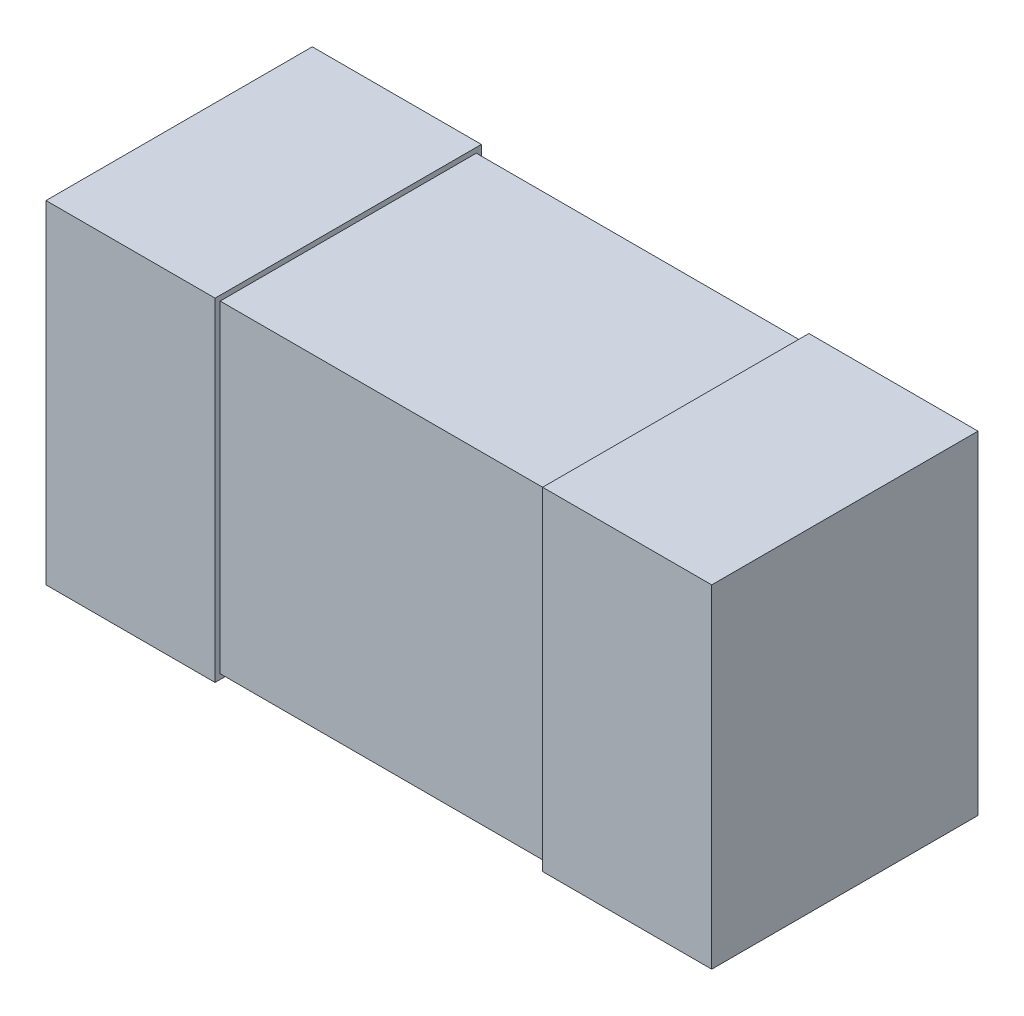
ISO-10303-21;
HEADER;
FILE_DESCRIPTION(('STEP AP214'),'2;1');
FILE_NAME('part.step','',(''),(''),'','','');
FILE_SCHEMA(('AUTOMOTIVE_DESIGN { 1 0 10303 214 1 1 1 1 }'));
ENDSEC;
DATA;
#1=APPLICATION_CONTEXT('core data for automotive mechanical design processes');
#2=APPLICATION_PROTOCOL_DEFINITION('international standard','automotive_design',2000,#1);
#3=PRODUCT_CONTEXT('',#1,'mechanical');
#4=PRODUCT('Part','Part','',(#3));
#5=PRODUCT_RELATED_PRODUCT_CATEGORY('part','',(#4));
#6=PRODUCT_DEFINITION_FORMATION('','',#4);
#7=PRODUCT_DEFINITION_CONTEXT('part definition',#1,'design');
#8=PRODUCT_DEFINITION('design','',#6,#7);
#9=PRODUCT_DEFINITION_SHAPE('','',#8);
#10=(LENGTH_UNIT() NAMED_UNIT(*) SI_UNIT(.MILLI.,.METRE.));
#11=(NAMED_UNIT(*) PLANE_ANGLE_UNIT() SI_UNIT($,.RADIAN.));
#12=(NAMED_UNIT(*) SI_UNIT($,.STERADIAN.) SOLID_ANGLE_UNIT());
#13=UNCERTAINTY_MEASURE_WITH_UNIT(LENGTH_MEASURE(1.E-05),#10,'distance_accuracy_value','');
#14=(GEOMETRIC_REPRESENTATION_CONTEXT(3) GLOBAL_UNCERTAINTY_ASSIGNED_CONTEXT((#13)) GLOBAL_UNIT_ASSIGNED_CONTEXT((#10,
#11,#12)) REPRESENTATION_CONTEXT('',''));
#15=CARTESIAN_POINT('',(0.,0.,0.));
#16=DIRECTION('',(0.,0.,1.));
#17=DIRECTION('',(1.,0.,0.));
#18=AXIS2_PLACEMENT_3D('',#15,#16,#17);
#19=CARTESIAN_POINT('',(0.5,-0.25,0.0762));
#20=DIRECTION('',(1.,0.,0.));
#21=DIRECTION('',(0.,1.,0.));
#22=AXIS2_PLACEMENT_3D('',#19,#20,#21);
#23=PLANE('',#22);
#24=DIRECTION('',(0.,1.,0.));
#25=VECTOR('',#24,1.);
#26=CARTESIAN_POINT('',(0.5,-0.25,0.0762));
#27=LINE('',#26,#25);
#28=CARTESIAN_POINT('',(0.5,-0.25,0.0762));
#29=VERTEX_POINT('',#28);
#30=CARTESIAN_POINT('',(0.5,0.25,0.0762));
#31=VERTEX_POINT('',#30);
#32=EDGE_CURVE('E147',#29,#31,#27,.T.);
#33=ORIENTED_EDGE('',*,*,#32,.T.);
#34=DIRECTION('',(0.,0.,1.));
#35=VECTOR('',#34,1.);
#36=CARTESIAN_POINT('',(0.5,0.25,0.0762));
#37=LINE('',#36,#35);
#38=CARTESIAN_POINT('',(0.5,0.25,0.4762));
#39=VERTEX_POINT('',#38);
#40=EDGE_CURVE('E231',#31,#39,#37,.T.);
#41=ORIENTED_EDGE('',*,*,#40,.T.);
#42=DIRECTION('',(0.,1.,0.));
#43=VECTOR('',#42,1.);
#44=CARTESIAN_POINT('',(0.5,-0.25,0.4762));
#45=LINE('',#44,#43);
#46=CARTESIAN_POINT('',(0.5,-0.25,0.4762));
#47=VERTEX_POINT('',#46);
#48=EDGE_CURVE('E188',#47,#39,#45,.T.);
#49=ORIENTED_EDGE('',*,*,#48,.F.);
#50=DIRECTION('',(0.,0.,1.));
#51=VECTOR('',#50,1.);
#52=CARTESIAN_POINT('',(0.5,-0.25,0.0762));
#53=LINE('',#52,#51);
#54=EDGE_CURVE('E11',#29,#47,#53,.T.);
#55=ORIENTED_EDGE('',*,*,#54,.F.);
#56=EDGE_LOOP('',(#33,#41,#49,#55));
#57=FACE_BOUND('',#56,.T.);
#58=ADVANCED_FACE('F17',(#57),#23,.T.);
#59=CARTESIAN_POINT('',(-0.5,0.25,0.0762));
#60=DIRECTION('',(-1.,0.,0.));
#61=DIRECTION('',(0.,0.,1.));
#62=AXIS2_PLACEMENT_3D('',#59,#60,#61);
#63=PLANE('',#62);
#64=DIRECTION('',(0.,-1.,0.));
#65=VECTOR('',#64,1.);
#66=CARTESIAN_POINT('',(-0.5,0.25,0.0762));
#67=LINE('',#66,#65);
#68=CARTESIAN_POINT('',(-0.5,0.25,0.0762));
#69=VERTEX_POINT('',#68);
#70=CARTESIAN_POINT('',(-0.5,-0.25,0.0762));
#71=VERTEX_POINT('',#70);
#72=EDGE_CURVE('E166',#69,#71,#67,.T.);
#73=ORIENTED_EDGE('',*,*,#72,.T.);
#74=DIRECTION('',(0.,0.,1.));
#75=VECTOR('',#74,1.);
#76=CARTESIAN_POINT('',(-0.5,-0.25,0.0762));
#77=LINE('',#76,#75);
#78=CARTESIAN_POINT('',(-0.5,-0.25,0.4762));
#79=VERTEX_POINT('',#78);
#80=EDGE_CURVE('E28',#71,#79,#77,.T.);
#81=ORIENTED_EDGE('',*,*,#80,.T.);
#82=DIRECTION('',(0.,-1.,0.));
#83=VECTOR('',#82,1.);
#84=CARTESIAN_POINT('',(-0.5,0.25,0.4762));
#85=LINE('',#84,#83);
#86=CARTESIAN_POINT('',(-0.5,0.25,0.4762));
#87=VERTEX_POINT('',#86);
#88=EDGE_CURVE('E220',#87,#79,#85,.T.);
#89=ORIENTED_EDGE('',*,*,#88,.F.);
#90=DIRECTION('',(0.,0.,1.));
#91=VECTOR('',#90,1.);
#92=CARTESIAN_POINT('',(-0.5,0.25,0.0762));
#93=LINE('',#92,#91);
#94=EDGE_CURVE('E222',#69,#87,#93,.T.);
#95=ORIENTED_EDGE('',*,*,#94,.F.);
#96=EDGE_LOOP('',(#73,#81,#89,#95));
#97=FACE_BOUND('',#96,.T.);
#98=ADVANCED_FACE('F274',(#97),#63,.T.);
#99=CARTESIAN_POINT('',(-0.5,-0.25,0.0762));
#100=DIRECTION('',(0.,-1.,0.));
#101=DIRECTION('',(0.,0.,-1.));
#102=AXIS2_PLACEMENT_3D('',#99,#100,#101);
#103=PLANE('',#102);
#104=DIRECTION('',(0.,0.,1.));
#105=VECTOR('',#104,1.);
#106=CARTESIAN_POINT('',(0.246,-0.25,0.0762));
#107=LINE('',#106,#105);
#108=CARTESIAN_POINT('',(0.246,-0.25,0.0762));
#109=VERTEX_POINT('',#108);
#110=CARTESIAN_POINT('',(0.246,-0.25,0.4762));
#111=VERTEX_POINT('',#110);
#112=EDGE_CURVE('E127',#109,#111,#107,.T.);
#113=ORIENTED_EDGE('',*,*,#112,.F.);
#114=DIRECTION('',(1.,0.,0.));
#115=VECTOR('',#114,1.);
#116=CARTESIAN_POINT('',(0.246,-0.25,0.0762));
#117=LINE('',#116,#115);
#118=EDGE_CURVE('E130',#109,#29,#117,.T.);
#119=ORIENTED_EDGE('',*,*,#118,.T.);
#120=ORIENTED_EDGE('',*,*,#54,.T.);
#121=DIRECTION('',(1.,0.,0.));
#122=VECTOR('',#121,1.);
#123=CARTESIAN_POINT('',(0.246,-0.25,0.4762));
#124=LINE('',#123,#122);
#125=EDGE_CURVE('E133',#111,#47,#124,.T.);
#126=ORIENTED_EDGE('',*,*,#125,.F.);
#127=EDGE_LOOP('',(#113,#119,#120,#126));
#128=FACE_BOUND('',#127,.T.);
#129=ADVANCED_FACE('F129',(#128),#103,.T.);
#130=CARTESIAN_POINT('',(-0.5,-0.25,0.0762));
#131=DIRECTION('',(0.,-1.,0.));
#132=DIRECTION('',(0.,0.,-1.));
#133=AXIS2_PLACEMENT_3D('',#130,#131,#132);
#134=PLANE('',#133);
#135=DIRECTION('',(0.,0.,1.));
#136=VECTOR('',#135,1.);
#137=CARTESIAN_POINT('',(-0.246,-0.25,0.0762));
#138=LINE('',#137,#136);
#139=CARTESIAN_POINT('',(-0.246,-0.25,0.0762));
#140=VERTEX_POINT('',#139);
#141=CARTESIAN_POINT('',(-0.246,-0.25,0.4762));
#142=VERTEX_POINT('',#141);
#143=EDGE_CURVE('E197',#140,#142,#138,.T.);
#144=ORIENTED_EDGE('',*,*,#143,.T.);
#145=DIRECTION('',(1.,0.,0.));
#146=VECTOR('',#145,1.);
#147=CARTESIAN_POINT('',(-0.5,-0.25,0.4762));
#148=LINE('',#147,#146);
#149=EDGE_CURVE('E189',#79,#142,#148,.T.);
#150=ORIENTED_EDGE('',*,*,#149,.F.);
#151=ORIENTED_EDGE('',*,*,#80,.F.);
#152=DIRECTION('',(1.,0.,0.));
#153=VECTOR('',#152,1.);
#154=CARTESIAN_POINT('',(-0.5,-0.25,0.0762));
#155=LINE('',#154,#153);
#156=EDGE_CURVE('E174',#71,#140,#155,.T.);
#157=ORIENTED_EDGE('',*,*,#156,.T.);
#158=EDGE_LOOP('',(#144,#150,#151,#157));
#159=FACE_BOUND('',#158,.T.);
#160=ADVANCED_FACE('F278',(#159),#134,.T.);
#161=CARTESIAN_POINT('',(0.,0.,0.4762));
#162=DIRECTION('',(0.,0.,1.));
#163=DIRECTION('',(1.,0.,0.));
#164=AXIS2_PLACEMENT_3D('',#161,#162,#163);
#165=PLANE('',#164);
#166=DIRECTION('',(0.,1.,0.));
#167=VECTOR('',#166,1.);
#168=CARTESIAN_POINT('',(0.246,-0.25,0.4762));
#169=LINE('',#168,#167);
#170=CARTESIAN_POINT('',(0.246,0.25,0.4762));
#171=VERTEX_POINT('',#170);
#172=EDGE_CURVE('E139',#111,#171,#169,.T.);
#173=ORIENTED_EDGE('',*,*,#172,.F.);
#174=ORIENTED_EDGE('',*,*,#125,.T.);
#175=ORIENTED_EDGE('',*,*,#48,.T.);
#176=DIRECTION('',(-1.,0.,0.));
#177=VECTOR('',#176,1.);
#178=CARTESIAN_POINT('',(0.5,0.25,0.4762));
#179=LINE('',#178,#177);
#180=EDGE_CURVE('E235',#39,#171,#179,.T.);
#181=ORIENTED_EDGE('',*,*,#180,.T.);
#182=EDGE_LOOP('',(#173,#174,#175,#181));
#183=FACE_BOUND('',#182,.T.);
#184=ADVANCED_FACE('F301',(#183),#165,.T.);
#185=CARTESIAN_POINT('',(0.,0.,0.4762));
#186=DIRECTION('',(0.,0.,1.));
#187=DIRECTION('',(1.,0.,0.));
#188=AXIS2_PLACEMENT_3D('',#185,#186,#187);
#189=PLANE('',#188);
#190=DIRECTION('',(0.,1.,0.));
#191=VECTOR('',#190,1.);
#192=CARTESIAN_POINT('',(-0.246,-0.25,0.4762));
#193=LINE('',#192,#191);
#194=CARTESIAN_POINT('',(-0.246,0.25,0.4762));
#195=VERTEX_POINT('',#194);
#196=EDGE_CURVE('E203',#142,#195,#193,.T.);
#197=ORIENTED_EDGE('',*,*,#196,.T.);
#198=DIRECTION('',(-1.,0.,0.));
#199=VECTOR('',#198,1.);
#200=CARTESIAN_POINT('',(-0.246,0.25,0.4762));
#201=LINE('',#200,#199);
#202=EDGE_CURVE('E230',#195,#87,#201,.T.);
#203=ORIENTED_EDGE('',*,*,#202,.T.);
#204=ORIENTED_EDGE('',*,*,#88,.T.);
#205=ORIENTED_EDGE('',*,*,#149,.T.);
#206=EDGE_LOOP('',(#197,#203,#204,#205));
#207=FACE_BOUND('',#206,.T.);
#208=ADVANCED_FACE('F267',(#207),#189,.T.);
#209=CARTESIAN_POINT('',(0.5,0.25,0.0762));
#210=DIRECTION('',(0.,1.,0.));
#211=DIRECTION('',(1.,0.,0.));
#212=AXIS2_PLACEMENT_3D('',#209,#210,#211);
#213=PLANE('',#212);
#214=DIRECTION('',(0.,0.,1.));
#215=VECTOR('',#214,1.);
#216=CARTESIAN_POINT('',(0.246,0.25,0.0762));
#217=LINE('',#216,#215);
#218=CARTESIAN_POINT('',(0.246,0.25,0.0762));
#219=VERTEX_POINT('',#218);
#220=EDGE_CURVE('E153',#219,#171,#217,.T.);
#221=ORIENTED_EDGE('',*,*,#220,.T.);
#222=ORIENTED_EDGE('',*,*,#180,.F.);
#223=ORIENTED_EDGE('',*,*,#40,.F.);
#224=DIRECTION('',(-1.,0.,0.));
#225=VECTOR('',#224,1.);
#226=CARTESIAN_POINT('',(0.5,0.25,0.0762));
#227=LINE('',#226,#225);
#228=EDGE_CURVE('E156',#31,#219,#227,.T.);
#229=ORIENTED_EDGE('',*,*,#228,.T.);
#230=EDGE_LOOP('',(#221,#222,#223,#229));
#231=FACE_BOUND('',#230,.T.);
#232=ADVANCED_FACE('F305',(#231),#213,.T.);
#233=CARTESIAN_POINT('',(0.5,0.25,0.0762));
#234=DIRECTION('',(0.,1.,0.));
#235=DIRECTION('',(1.,0.,0.));
#236=AXIS2_PLACEMENT_3D('',#233,#234,#235);
#237=PLANE('',#236);
#238=DIRECTION('',(0.,0.,1.));
#239=VECTOR('',#238,1.);
#240=CARTESIAN_POINT('',(-0.246,0.25,0.0762));
#241=LINE('',#240,#239);
#242=CARTESIAN_POINT('',(-0.246,0.25,0.0762));
#243=VERTEX_POINT('',#242);
#244=EDGE_CURVE('E149',#243,#195,#241,.T.);
#245=ORIENTED_EDGE('',*,*,#244,.F.);
#246=DIRECTION('',(-1.,0.,0.));
#247=VECTOR('',#246,1.);
#248=CARTESIAN_POINT('',(-0.246,0.25,0.0762));
#249=LINE('',#248,#247);
#250=EDGE_CURVE('E157',#243,#69,#249,.T.);
#251=ORIENTED_EDGE('',*,*,#250,.T.);
#252=ORIENTED_EDGE('',*,*,#94,.T.);
#253=ORIENTED_EDGE('',*,*,#202,.F.);
#254=EDGE_LOOP('',(#245,#251,#252,#253));
#255=FACE_BOUND('',#254,.T.);
#256=ADVANCED_FACE('F270',(#255),#237,.T.);
#257=CARTESIAN_POINT('',(0.246,-0.25,0.08382));
#258=DIRECTION('',(1.,0.,0.));
#259=DIRECTION('',(0.,1.,0.));
#260=AXIS2_PLACEMENT_3D('',#257,#258,#259);
#261=PLANE('',#260);
#262=DIRECTION('',(0.,1.,0.));
#263=VECTOR('',#262,1.);
#264=CARTESIAN_POINT('',(0.246,-0.24238,0.08382));
#265=LINE('',#264,#263);
#266=CARTESIAN_POINT('',(0.246,-0.24238,0.08382));
#267=VERTEX_POINT('',#266);
#268=CARTESIAN_POINT('',(0.246,0.24238,0.08382));
#269=VERTEX_POINT('',#268);
#270=EDGE_CURVE('E140',#267,#269,#265,.T.);
#271=ORIENTED_EDGE('',*,*,#270,.T.);
#272=DIRECTION('',(0.,0.,1.));
#273=VECTOR('',#272,1.);
#274=CARTESIAN_POINT('',(0.246,0.24238,0.08382));
#275=LINE('',#274,#273);
#276=CARTESIAN_POINT('',(0.246,0.24238,0.46858));
#277=VERTEX_POINT('',#276);
#278=EDGE_CURVE('E175',#269,#277,#275,.T.);
#279=ORIENTED_EDGE('',*,*,#278,.T.);
#280=DIRECTION('',(0.,-1.,0.));
#281=VECTOR('',#280,1.);
#282=CARTESIAN_POINT('',(0.246,0.24238,0.46858));
#283=LINE('',#282,#281);
#284=CARTESIAN_POINT('',(0.246,-0.24238,0.46858));
#285=VERTEX_POINT('',#284);
#286=EDGE_CURVE('E184',#277,#285,#283,.T.);
#287=ORIENTED_EDGE('',*,*,#286,.T.);
#288=DIRECTION('',(0.,0.,-1.));
#289=VECTOR('',#288,1.);
#290=CARTESIAN_POINT('',(0.246,-0.24238,0.46858));
#291=LINE('',#290,#289);
#292=EDGE_CURVE('E185',#285,#267,#291,.T.);
#293=ORIENTED_EDGE('',*,*,#292,.T.);
#294=EDGE_LOOP('',(#271,#279,#287,#293));
#295=FACE_BOUND('',#294,.T.);
#296=DIRECTION('',(0.,1.,0.));
#297=VECTOR('',#296,1.);
#298=CARTESIAN_POINT('',(0.246,-0.25,0.0762));
#299=LINE('',#298,#297);
#300=EDGE_CURVE('E145',#109,#219,#299,.T.);
#301=ORIENTED_EDGE('',*,*,#300,.F.);
#302=ORIENTED_EDGE('',*,*,#112,.T.);
#303=ORIENTED_EDGE('',*,*,#172,.T.);
#304=ORIENTED_EDGE('',*,*,#220,.F.);
#305=EDGE_LOOP('',(#301,#302,#303,#304));
#306=FACE_BOUND('',#305,.T.);
#307=ADVANCED_FACE('F151',(#295,#306),#261,.F.);
#308=CARTESIAN_POINT('',(-0.246,-0.25,0.08382));
#309=DIRECTION('',(0.,0.,1.));
#310=DIRECTION('',(1.,0.,0.));
#311=AXIS2_PLACEMENT_3D('',#308,#309,#310);
#312=PLANE('',#311);
#313=DIRECTION('',(1.,0.,0.));
#314=VECTOR('',#313,1.);
#315=CARTESIAN_POINT('',(-0.246,-0.24238,0.08382));
#316=LINE('',#315,#314);
#317=CARTESIAN_POINT('',(-0.246,-0.24238,0.08382));
#318=VERTEX_POINT('',#317);
#319=EDGE_CURVE('E255',#318,#267,#316,.T.);
#320=ORIENTED_EDGE('',*,*,#319,.F.);
#321=DIRECTION('',(0.,1.,0.));
#322=VECTOR('',#321,1.);
#323=CARTESIAN_POINT('',(-0.246,-0.24238,0.08382));
#324=LINE('',#323,#322);
#325=CARTESIAN_POINT('',(-0.246,0.24238,0.08382));
#326=VERTEX_POINT('',#325);
#327=EDGE_CURVE('E21',#318,#326,#324,.T.);
#328=ORIENTED_EDGE('',*,*,#327,.T.);
#329=DIRECTION('',(1.,0.,0.));
#330=VECTOR('',#329,1.);
#331=CARTESIAN_POINT('',(-0.246,0.24238,0.08382));
#332=LINE('',#331,#330);
#333=EDGE_CURVE('E179',#326,#269,#332,.T.);
#334=ORIENTED_EDGE('',*,*,#333,.T.);
#335=ORIENTED_EDGE('',*,*,#270,.F.);
#336=EDGE_LOOP('',(#320,#328,#334,#335));
#337=FACE_BOUND('',#336,.T.);
#338=ADVANCED_FACE('F19',(#337),#312,.F.);
#339=CARTESIAN_POINT('',(-0.246,0.24238,0.0762));
#340=DIRECTION('',(0.,-1.,0.));
#341=DIRECTION('',(0.,0.,-1.));
#342=AXIS2_PLACEMENT_3D('',#339,#340,#341);
#343=PLANE('',#342);
#344=ORIENTED_EDGE('',*,*,#333,.F.);
#345=DIRECTION('',(0.,0.,1.));
#346=VECTOR('',#345,1.);
#347=CARTESIAN_POINT('',(-0.246,0.24238,0.08382));
#348=LINE('',#347,#346);
#349=CARTESIAN_POINT('',(-0.246,0.24238,0.46858));
#350=VERTEX_POINT('',#349);
#351=EDGE_CURVE('E214',#326,#350,#348,.T.);
#352=ORIENTED_EDGE('',*,*,#351,.T.);
#353=DIRECTION('',(1.,0.,0.));
#354=VECTOR('',#353,1.);
#355=CARTESIAN_POINT('',(-0.246,0.24238,0.46858));
#356=LINE('',#355,#354);
#357=EDGE_CURVE('E180',#350,#277,#356,.T.);
#358=ORIENTED_EDGE('',*,*,#357,.T.);
#359=ORIENTED_EDGE('',*,*,#278,.F.);
#360=EDGE_LOOP('',(#344,#352,#358,#359));
#361=FACE_BOUND('',#360,.T.);
#362=ADVANCED_FACE('F314',(#361),#343,.F.);
#363=CARTESIAN_POINT('',(-0.246,0.25,0.46858));
#364=DIRECTION('',(0.,0.,-1.));
#365=DIRECTION('',(0.,-1.,0.));
#366=AXIS2_PLACEMENT_3D('',#363,#364,#365);
#367=PLANE('',#366);
#368=ORIENTED_EDGE('',*,*,#357,.F.);
#369=DIRECTION('',(0.,-1.,0.));
#370=VECTOR('',#369,1.);
#371=CARTESIAN_POINT('',(-0.246,0.24238,0.46858));
#372=LINE('',#371,#370);
#373=CARTESIAN_POINT('',(-0.246,-0.24238,0.46858));
#374=VERTEX_POINT('',#373);
#375=EDGE_CURVE('E196',#350,#374,#372,.T.);
#376=ORIENTED_EDGE('',*,*,#375,.T.);
#377=DIRECTION('',(1.,0.,0.));
#378=VECTOR('',#377,1.);
#379=CARTESIAN_POINT('',(-0.246,-0.24238,0.46858));
#380=LINE('',#379,#378);
#381=EDGE_CURVE('E251',#374,#285,#380,.T.);
#382=ORIENTED_EDGE('',*,*,#381,.T.);
#383=ORIENTED_EDGE('',*,*,#286,.F.);
#384=EDGE_LOOP('',(#368,#376,#382,#383));
#385=FACE_BOUND('',#384,.T.);
#386=ADVANCED_FACE('F311',(#385),#367,.F.);
#387=CARTESIAN_POINT('',(-0.246,-0.24238,0.4762));
#388=DIRECTION('',(0.,1.,0.));
#389=DIRECTION('',(1.,0.,0.));
#390=AXIS2_PLACEMENT_3D('',#387,#388,#389);
#391=PLANE('',#390);
#392=ORIENTED_EDGE('',*,*,#381,.F.);
#393=DIRECTION('',(0.,0.,-1.));
#394=VECTOR('',#393,1.);
#395=CARTESIAN_POINT('',(-0.246,-0.24238,0.46858));
#396=LINE('',#395,#394);
#397=EDGE_CURVE('E192',#374,#318,#396,.T.);
#398=ORIENTED_EDGE('',*,*,#397,.T.);
#399=ORIENTED_EDGE('',*,*,#319,.T.);
#400=ORIENTED_EDGE('',*,*,#292,.F.);
#401=EDGE_LOOP('',(#392,#398,#399,#400));
#402=FACE_BOUND('',#401,.T.);
#403=ADVANCED_FACE('F313',(#402),#391,.F.);
#404=CARTESIAN_POINT('',(-0.246,-0.25,0.0762));
#405=DIRECTION('',(-1.,0.,0.));
#406=DIRECTION('',(0.,0.,1.));
#407=AXIS2_PLACEMENT_3D('',#404,#405,#406);
#408=PLANE('',#407);
#409=ORIENTED_EDGE('',*,*,#397,.F.);
#410=ORIENTED_EDGE('',*,*,#375,.F.);
#411=ORIENTED_EDGE('',*,*,#351,.F.);
#412=ORIENTED_EDGE('',*,*,#327,.F.);
#413=EDGE_LOOP('',(#409,#410,#411,#412));
#414=FACE_BOUND('',#413,.T.);
#415=DIRECTION('',(0.,1.,0.));
#416=VECTOR('',#415,1.);
#417=CARTESIAN_POINT('',(-0.246,-0.25,0.0762));
#418=LINE('',#417,#416);
#419=EDGE_CURVE('E170',#140,#243,#418,.T.);
#420=ORIENTED_EDGE('',*,*,#419,.T.);
#421=ORIENTED_EDGE('',*,*,#244,.T.);
#422=ORIENTED_EDGE('',*,*,#196,.F.);
#423=ORIENTED_EDGE('',*,*,#143,.F.);
#424=EDGE_LOOP('',(#420,#421,#422,#423));
#425=FACE_BOUND('',#424,.T.);
#426=ADVANCED_FACE('F281',(#414,#425),#408,.F.);
#427=CARTESIAN_POINT('',(0.,0.,0.0762));
#428=DIRECTION('',(0.,0.,1.));
#429=DIRECTION('',(1.,0.,0.));
#430=AXIS2_PLACEMENT_3D('',#427,#428,#429);
#431=PLANE('',#430);
#432=ORIENTED_EDGE('',*,*,#300,.T.);
#433=ORIENTED_EDGE('',*,*,#228,.F.);
#434=ORIENTED_EDGE('',*,*,#32,.F.);
#435=ORIENTED_EDGE('',*,*,#118,.F.);
#436=EDGE_LOOP('',(#432,#433,#434,#435));
#437=FACE_BOUND('',#436,.T.);
#438=ADVANCED_FACE('F143',(#437),#431,.F.);
#439=CARTESIAN_POINT('',(0.,0.,0.0762));
#440=DIRECTION('',(0.,0.,1.));
#441=DIRECTION('',(1.,0.,0.));
#442=AXIS2_PLACEMENT_3D('',#439,#440,#441);
#443=PLANE('',#442);
#444=ORIENTED_EDGE('',*,*,#419,.F.);
#445=ORIENTED_EDGE('',*,*,#156,.F.);
#446=ORIENTED_EDGE('',*,*,#72,.F.);
#447=ORIENTED_EDGE('',*,*,#250,.F.);
#448=EDGE_LOOP('',(#444,#445,#446,#447));
#449=FACE_BOUND('',#448,.T.);
#450=ADVANCED_FACE('F283',(#449),#443,.F.);
#451=CLOSED_SHELL('',(#58,#98,#129,#160,#184,#208,#232,#256,#307,#338,#362,#386,#403,#426,#438,#450));
#452=MANIFOLD_SOLID_BREP('B1',#451);
#453=ADVANCED_BREP_SHAPE_REPRESENTATION('',(#18,#452),#14);
#454=SHAPE_DEFINITION_REPRESENTATION(#9,#453);
ENDSEC;
END-ISO-10303-21;
